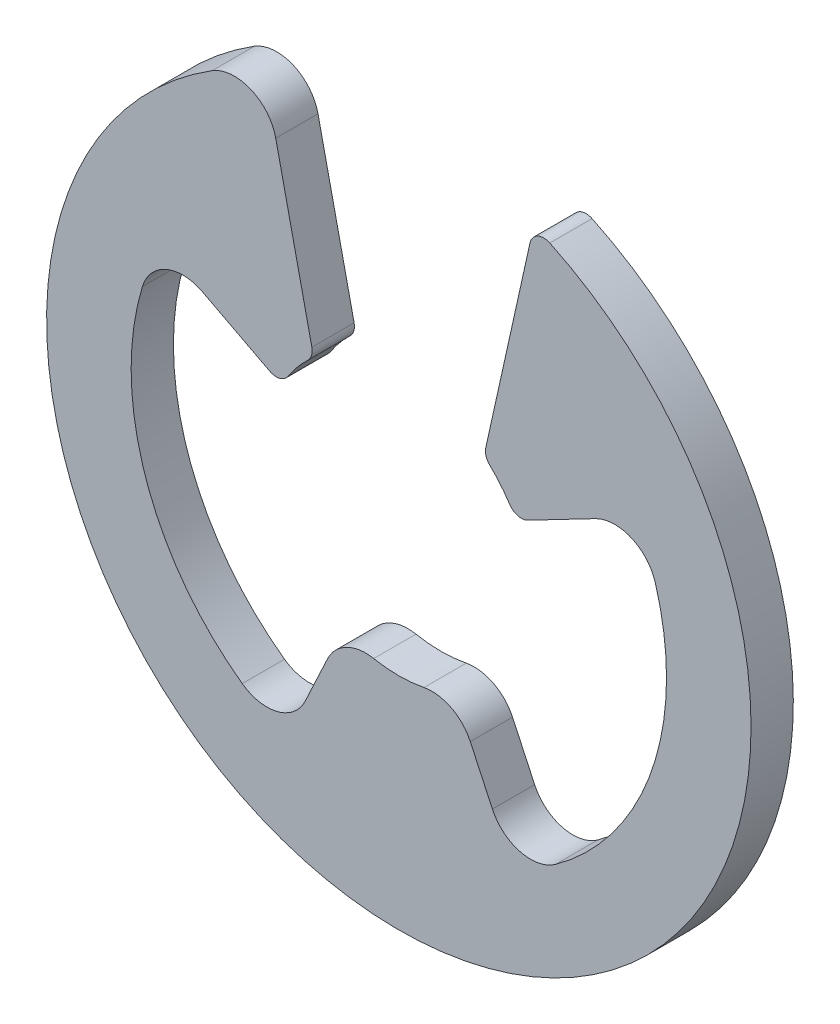
ISO-10303-21;
HEADER;
FILE_DESCRIPTION(('STEP AP214'),'2;1');
FILE_NAME('part.step','',(''),(''),'','','');
FILE_SCHEMA(('AUTOMOTIVE_DESIGN { 1 0 10303 214 1 1 1 1 }'));
ENDSEC;
DATA;
#1=APPLICATION_CONTEXT('core data for automotive mechanical design processes');
#2=APPLICATION_PROTOCOL_DEFINITION('international standard','automotive_design',2000,#1);
#3=PRODUCT_CONTEXT('',#1,'mechanical');
#4=PRODUCT('Part','Part','',(#3));
#5=PRODUCT_RELATED_PRODUCT_CATEGORY('part','',(#4));
#6=PRODUCT_DEFINITION_FORMATION('','',#4);
#7=PRODUCT_DEFINITION_CONTEXT('part definition',#1,'design');
#8=PRODUCT_DEFINITION('design','',#6,#7);
#9=PRODUCT_DEFINITION_SHAPE('','',#8);
#10=(LENGTH_UNIT() NAMED_UNIT(*) SI_UNIT(.MILLI.,.METRE.));
#11=(NAMED_UNIT(*) PLANE_ANGLE_UNIT() SI_UNIT($,.RADIAN.));
#12=(NAMED_UNIT(*) SI_UNIT($,.STERADIAN.) SOLID_ANGLE_UNIT());
#13=UNCERTAINTY_MEASURE_WITH_UNIT(LENGTH_MEASURE(1.E-05),#10,'distance_accuracy_value','');
#14=(GEOMETRIC_REPRESENTATION_CONTEXT(3) GLOBAL_UNCERTAINTY_ASSIGNED_CONTEXT((#13)) GLOBAL_UNIT_ASSIGNED_CONTEXT((#10,
#11,#12)) REPRESENTATION_CONTEXT('',''));
#15=CARTESIAN_POINT('',(0.,0.,0.));
#16=DIRECTION('',(0.,0.,1.));
#17=DIRECTION('',(1.,0.,0.));
#18=AXIS2_PLACEMENT_3D('',#15,#16,#17);
#19=CARTESIAN_POINT('',(0.,0.,0.1905));
#20=DIRECTION('',(0.,0.,1.));
#21=DIRECTION('',(1.,0.,0.));
#22=AXIS2_PLACEMENT_3D('',#19,#20,#21);
#23=PLANE('',#22);
#24=DIRECTION('',(0.216439613938083,0.976296007119938,0.));
#25=VECTOR('',#24,1.);
#26=CARTESIAN_POINT('',(0.539598954254984,-0.11962620812603,0.1905));
#27=LINE('',#26,#25);
#28=CARTESIAN_POINT('',(0.783911570769453,0.982396788737823,0.1905));
#29=VERTEX_POINT('',#28);
#30=CARTESIAN_POINT('',(1.18269461582631,2.78119086119221,0.1905));
#31=VERTEX_POINT('',#30);
#32=EDGE_CURVE('E213',#29,#31,#27,.T.);
#33=ORIENTED_EDGE('',*,*,#32,.F.);
#34=CARTESIAN_POINT('',(0.907901163673686,0.954908957767687,0.1905));
#35=DIRECTION('',(0.,0.,1.));
#36=DIRECTION('',(1.,0.,0.));
#37=AXIS2_PLACEMENT_3D('',#34,#35,#36);
#38=CIRCLE('',#37,0.127);
#39=CARTESIAN_POINT('',(0.820392617777427,0.862869540151524,0.1905));
#40=VERTEX_POINT('',#39);
#41=EDGE_CURVE('E196',#29,#40,#38,.T.);
#42=ORIENTED_EDGE('',*,*,#41,.T.);
#43=CARTESIAN_POINT('',(0.,0.,0.1905));
#44=DIRECTION('',(0.,0.,1.));
#45=DIRECTION('',(1.,0.,0.));
#46=AXIS2_PLACEMENT_3D('',#43,#44,#45);
#47=CIRCLE('',#46,1.190625);
#48=CARTESIAN_POINT('',(0.998190337560011,0.649002265502081,0.1905));
#49=VERTEX_POINT('',#48);
#50=EDGE_CURVE('E232',#49,#40,#47,.T.);
#51=ORIENTED_EDGE('',*,*,#50,.F.);
#52=CARTESIAN_POINT('',(1.10466397356641,0.718229173822303,0.1905));
#53=DIRECTION('',(0.,0.,1.));
#54=DIRECTION('',(1.,0.,0.));
#55=AXIS2_PLACEMENT_3D('',#52,#53,#54);
#56=CIRCLE('',#55,0.127);
#57=CARTESIAN_POINT('',(1.16330604744726,0.605578798008671,0.1905));
#58=VERTEX_POINT('',#57);
#59=EDGE_CURVE('E207',#49,#58,#56,.T.);
#60=ORIENTED_EDGE('',*,*,#59,.T.);
#61=DIRECTION('',(-0.88701083317821,-0.461748613235057,0.));
#62=VECTOR('',#61,1.);
#63=CARTESIAN_POINT('',(0.,0.,0.1905));
#64=LINE('',#63,#62);
#65=CARTESIAN_POINT('',(1.77043962654063,0.921632534568249,0.1905));
#66=VERTEX_POINT('',#65);
#67=EDGE_CURVE('E397',#66,#58,#64,.T.);
#68=ORIENTED_EDGE('',*,*,#67,.F.);
#69=CARTESIAN_POINT('',(1.94636584818318,0.583681407127351,0.1905));
#70=DIRECTION('',(0.,0.,1.));
#71=DIRECTION('',(1.,0.,0.));
#72=AXIS2_PLACEMENT_3D('',#69,#70,#71);
#73=CIRCLE('',#72,0.381);
#74=CARTESIAN_POINT('',(2.31130944471753,0.693121670963728,0.1905));
#75=VERTEX_POINT('',#74);
#76=EDGE_CURVE('E326',#66,#75,#73,.F.);
#77=ORIENTED_EDGE('',*,*,#76,.T.);
#78=CARTESIAN_POINT('',(0.,0.,0.1905));
#79=DIRECTION('',(0.,0.,1.));
#80=DIRECTION('',(1.,0.,0.));
#81=AXIS2_PLACEMENT_3D('',#78,#79,#80);
#82=CIRCLE('',#81,2.413);
#83=CARTESIAN_POINT('',(1.4114582097649,-1.95712920423953,0.1905));
#84=VERTEX_POINT('',#83);
#85=EDGE_CURVE('E394',#84,#75,#82,.T.);
#86=ORIENTED_EDGE('',*,*,#85,.F.);
#87=CARTESIAN_POINT('',(1.18859638717044,-1.64810880357013,0.1905));
#88=DIRECTION('',(0.,0.,1.));
#89=DIRECTION('',(1.,0.,0.));
#90=AXIS2_PLACEMENT_3D('',#87,#88,#89);
#91=CIRCLE('',#90,0.381);
#92=CARTESIAN_POINT('',(0.843293120309479,-1.80912636129334,0.1905));
#93=VERTEX_POINT('',#92);
#94=EDGE_CURVE('E330',#84,#93,#91,.F.);
#95=ORIENTED_EDGE('',*,*,#94,.T.);
#96=DIRECTION('',(0.4226182617407,-0.90630778703665,0.));
#97=VECTOR('',#96,1.);
#98=CARTESIAN_POINT('',(-0.000259853295256014,-0.000121171581574692,0.1905));
#99=LINE('',#98,#97);
#100=CARTESIAN_POINT('',(0.644094498053936,-1.38194353731036,0.1905));
#101=VERTEX_POINT('',#100);
#102=EDGE_CURVE('E363',#101,#93,#99,.T.);
#103=ORIENTED_EDGE('',*,*,#102,.F.);
#104=CARTESIAN_POINT('',(0.298791231192973,-1.54296109503357,0.1905));
#105=DIRECTION('',(0.,0.,1.));
#106=DIRECTION('',(1.,0.,0.));
#107=AXIS2_PLACEMENT_3D('',#104,#105,#106);
#108=CIRCLE('',#107,0.381);
#109=CARTESIAN_POINT('',(0.22635699332801,-1.16890992047998,0.1905));
#110=VERTEX_POINT('',#109);
#111=EDGE_CURVE('E250',#101,#110,#108,.T.);
#112=ORIENTED_EDGE('',*,*,#111,.T.);
#113=CARTESIAN_POINT('',(-0.22635699332801,-1.16890992047998,0.1905));
#114=VERTEX_POINT('',#113);
#115=EDGE_CURVE('E234',#114,#110,#47,.T.);
#116=ORIENTED_EDGE('',*,*,#115,.F.);
#117=CARTESIAN_POINT('',(-0.298791231192973,-1.54296109503357,0.1905));
#118=DIRECTION('',(0.,0.,1.));
#119=DIRECTION('',(1.,0.,0.));
#120=AXIS2_PLACEMENT_3D('',#117,#118,#119);
#121=CIRCLE('',#120,0.381);
#122=CARTESIAN_POINT('',(-0.644094498053936,-1.38194353731036,0.1905));
#123=VERTEX_POINT('',#122);
#124=EDGE_CURVE('E248',#114,#123,#121,.T.);
#125=ORIENTED_EDGE('',*,*,#124,.T.);
#126=DIRECTION('',(-0.4226182617407,-0.90630778703665,0.));
#127=VECTOR('',#126,1.);
#128=CARTESIAN_POINT('',(0.000259853295256014,-0.000121171581574692,0.1905));
#129=LINE('',#128,#127);
#130=CARTESIAN_POINT('',(-0.843293120309479,-1.80912636129334,0.1905));
#131=VERTEX_POINT('',#130);
#132=EDGE_CURVE('E365',#123,#131,#129,.T.);
#133=ORIENTED_EDGE('',*,*,#132,.T.);
#134=CARTESIAN_POINT('',(-1.18859638717044,-1.64810880357013,0.1905));
#135=DIRECTION('',(0.,0.,1.));
#136=DIRECTION('',(1.,0.,0.));
#137=AXIS2_PLACEMENT_3D('',#134,#135,#136);
#138=CIRCLE('',#137,0.381);
#139=CARTESIAN_POINT('',(-1.4114582097649,-1.95712920423953,0.1905));
#140=VERTEX_POINT('',#139);
#141=EDGE_CURVE('E334',#131,#140,#138,.F.);
#142=ORIENTED_EDGE('',*,*,#141,.T.);
#143=CARTESIAN_POINT('',(0.,0.,0.1905));
#144=DIRECTION('',(0.,0.,1.));
#145=DIRECTION('',(1.,0.,0.));
#146=AXIS2_PLACEMENT_3D('',#143,#144,#145);
#147=CIRCLE('',#146,2.413);
#148=CARTESIAN_POINT('',(-2.31130944471753,0.693121670963728,0.1905));
#149=VERTEX_POINT('',#148);
#150=EDGE_CURVE('E341',#149,#140,#147,.T.);
#151=ORIENTED_EDGE('',*,*,#150,.F.);
#152=CARTESIAN_POINT('',(-1.94636584818318,0.583681407127351,0.1905));
#153=DIRECTION('',(0.,0.,1.));
#154=DIRECTION('',(1.,0.,0.));
#155=AXIS2_PLACEMENT_3D('',#152,#153,#154);
#156=CIRCLE('',#155,0.381);
#157=CARTESIAN_POINT('',(-1.77043962654063,0.921632534568249,0.1905));
#158=VERTEX_POINT('',#157);
#159=EDGE_CURVE('E42',#149,#158,#156,.F.);
#160=ORIENTED_EDGE('',*,*,#159,.T.);
#161=DIRECTION('',(0.88701083317821,-0.461748613235057,0.));
#162=VECTOR('',#161,1.);
#163=CARTESIAN_POINT('',(0.,0.,0.1905));
#164=LINE('',#163,#162);
#165=CARTESIAN_POINT('',(-1.16330604744726,0.605578798008671,0.1905));
#166=VERTEX_POINT('',#165);
#167=EDGE_CURVE('E339',#158,#166,#164,.T.);
#168=ORIENTED_EDGE('',*,*,#167,.T.);
#169=CARTESIAN_POINT('',(-1.10466397356641,0.718229173822303,0.1905));
#170=DIRECTION('',(0.,0.,1.));
#171=DIRECTION('',(1.,0.,0.));
#172=AXIS2_PLACEMENT_3D('',#169,#170,#171);
#173=CIRCLE('',#172,0.127);
#174=CARTESIAN_POINT('',(-0.998190337560011,0.649002265502081,0.1905));
#175=VERTEX_POINT('',#174);
#176=EDGE_CURVE('E255',#166,#175,#173,.T.);
#177=ORIENTED_EDGE('',*,*,#176,.T.);
#178=CARTESIAN_POINT('',(-0.820392617777427,0.862869540151524,0.1905));
#179=VERTEX_POINT('',#178);
#180=EDGE_CURVE('E236',#179,#175,#47,.T.);
#181=ORIENTED_EDGE('',*,*,#180,.F.);
#182=CARTESIAN_POINT('',(-0.907901163673685,0.954908957767687,0.1905));
#183=DIRECTION('',(0.,0.,1.));
#184=DIRECTION('',(1.,0.,0.));
#185=AXIS2_PLACEMENT_3D('',#182,#183,#184);
#186=CIRCLE('',#185,0.127);
#187=CARTESIAN_POINT('',(-0.783911570769453,0.982396788737824,0.1905));
#188=VERTEX_POINT('',#187);
#189=EDGE_CURVE('E253',#179,#188,#186,.T.);
#190=ORIENTED_EDGE('',*,*,#189,.T.);
#191=DIRECTION('',(0.216439613938083,-0.976296007119938,0.));
#192=VECTOR('',#191,1.);
#193=CARTESIAN_POINT('',(-0.539598954254984,-0.11962620812603,0.1905));
#194=LINE('',#193,#192);
#195=CARTESIAN_POINT('',(-1.10956464167249,2.45132286490398,0.1905));
#196=VERTEX_POINT('',#195);
#197=EDGE_CURVE('E223',#196,#188,#194,.T.);
#198=ORIENTED_EDGE('',*,*,#197,.F.);
#199=CARTESIAN_POINT('',(-1.48153342038519,2.36885937199357,0.1905));
#200=DIRECTION('',(0.,0.,1.));
#201=DIRECTION('',(1.,0.,0.));
#202=AXIS2_PLACEMENT_3D('',#199,#200,#201);
#203=CIRCLE('',#202,0.381);
#204=CARTESIAN_POINT('',(-1.68356070498317,2.69188564999269,0.1905));
#205=VERTEX_POINT('',#204);
#206=EDGE_CURVE('E217',#196,#205,#203,.T.);
#207=ORIENTED_EDGE('',*,*,#206,.T.);
#208=CARTESIAN_POINT('',(0.,0.,0.1905));
#209=DIRECTION('',(0.,0.,1.));
#210=DIRECTION('',(1.,0.,0.));
#211=AXIS2_PLACEMENT_3D('',#208,#209,#210);
#212=CIRCLE('',#211,3.175);
#213=CARTESIAN_POINT('',(1.36112938409431,2.86844065648133,0.1905));
#214=VERTEX_POINT('',#213);
#215=EDGE_CURVE('E241',#205,#214,#212,.T.);
#216=ORIENTED_EDGE('',*,*,#215,.T.);
#217=CARTESIAN_POINT('',(1.30668420873054,2.75370303022208,0.1905));
#218=DIRECTION('',(0.,0.,1.));
#219=DIRECTION('',(1.,0.,0.));
#220=AXIS2_PLACEMENT_3D('',#217,#218,#219);
#221=CIRCLE('',#220,0.127);
#222=EDGE_CURVE('E221',#214,#31,#221,.T.);
#223=ORIENTED_EDGE('',*,*,#222,.T.);
#224=EDGE_LOOP('',(#33,#42,#51,#60,#68,#77,#86,#95,#103,#112,#116,#125,#133,#142,#151,#160,#168,
#177,#181,#190,#198,#207,#216,#223));
#225=FACE_BOUND('',#224,.T.);
#226=ADVANCED_FACE('F34',(#225),#23,.T.);
#227=CARTESIAN_POINT('',(0.,0.,-0.1905));
#228=DIRECTION('',(0.,0.,1.));
#229=DIRECTION('',(1.,0.,0.));
#230=AXIS2_PLACEMENT_3D('',#227,#228,#229);
#231=PLANE('',#230);
#232=CARTESIAN_POINT('',(0.,0.,-0.1905));
#233=DIRECTION('',(0.,0.,1.));
#234=DIRECTION('',(1.,0.,0.));
#235=AXIS2_PLACEMENT_3D('',#232,#233,#234);
#236=CIRCLE('',#235,1.190625);
#237=CARTESIAN_POINT('',(0.998190337560011,0.649002265502081,-0.1905));
#238=VERTEX_POINT('',#237);
#239=CARTESIAN_POINT('',(0.820392617777427,0.862869540151524,-0.1905));
#240=VERTEX_POINT('',#239);
#241=EDGE_CURVE('E240',#238,#240,#236,.T.);
#242=ORIENTED_EDGE('',*,*,#241,.T.);
#243=CARTESIAN_POINT('',(0.907901163673686,0.954908957767687,-0.1905));
#244=DIRECTION('',(0.,0.,1.));
#245=DIRECTION('',(1.,0.,0.));
#246=AXIS2_PLACEMENT_3D('',#243,#244,#245);
#247=CIRCLE('',#246,0.127);
#248=CARTESIAN_POINT('',(0.783911570769453,0.982396788737823,-0.1905));
#249=VERTEX_POINT('',#248);
#250=EDGE_CURVE('E275',#240,#249,#247,.F.);
#251=ORIENTED_EDGE('',*,*,#250,.T.);
#252=DIRECTION('',(0.216439613938083,0.976296007119938,0.));
#253=VECTOR('',#252,1.);
#254=CARTESIAN_POINT('',(0.539598954254984,-0.11962620812603,-0.1905));
#255=LINE('',#254,#253);
#256=CARTESIAN_POINT('',(1.18269461582631,2.78119086119221,-0.1905));
#257=VERTEX_POINT('',#256);
#258=EDGE_CURVE('E216',#249,#257,#255,.T.);
#259=ORIENTED_EDGE('',*,*,#258,.T.);
#260=CARTESIAN_POINT('',(1.30668420873054,2.75370303022208,-0.1905));
#261=DIRECTION('',(0.,0.,1.));
#262=DIRECTION('',(1.,0.,0.));
#263=AXIS2_PLACEMENT_3D('',#260,#261,#262);
#264=CIRCLE('',#263,0.127);
#265=CARTESIAN_POINT('',(1.36112938409431,2.86844065648133,-0.1905));
#266=VERTEX_POINT('',#265);
#267=EDGE_CURVE('E267',#257,#266,#264,.F.);
#268=ORIENTED_EDGE('',*,*,#267,.T.);
#269=CARTESIAN_POINT('',(0.,0.,-0.1905));
#270=DIRECTION('',(0.,0.,1.));
#271=DIRECTION('',(1.,0.,0.));
#272=AXIS2_PLACEMENT_3D('',#269,#270,#271);
#273=CIRCLE('',#272,3.175);
#274=CARTESIAN_POINT('',(-1.68356070498317,2.69188564999269,-0.1905));
#275=VERTEX_POINT('',#274);
#276=EDGE_CURVE('E243',#275,#266,#273,.T.);
#277=ORIENTED_EDGE('',*,*,#276,.F.);
#278=CARTESIAN_POINT('',(-1.48153342038519,2.36885937199357,-0.1905));
#279=DIRECTION('',(0.,0.,1.));
#280=DIRECTION('',(1.,0.,0.));
#281=AXIS2_PLACEMENT_3D('',#278,#279,#280);
#282=CIRCLE('',#281,0.381);
#283=CARTESIAN_POINT('',(-1.10956464167249,2.45132286490398,-0.1905));
#284=VERTEX_POINT('',#283);
#285=EDGE_CURVE('E261',#275,#284,#282,.F.);
#286=ORIENTED_EDGE('',*,*,#285,.T.);
#287=DIRECTION('',(0.216439613938083,-0.976296007119938,0.));
#288=VECTOR('',#287,1.);
#289=CARTESIAN_POINT('',(-0.539598954254984,-0.11962620812603,-0.1905));
#290=LINE('',#289,#288);
#291=CARTESIAN_POINT('',(-0.783911570769453,0.982396788737824,-0.1905));
#292=VERTEX_POINT('',#291);
#293=EDGE_CURVE('E222',#284,#292,#290,.T.);
#294=ORIENTED_EDGE('',*,*,#293,.T.);
#295=CARTESIAN_POINT('',(-0.907901163673685,0.954908957767687,-0.1905));
#296=DIRECTION('',(0.,0.,1.));
#297=DIRECTION('',(1.,0.,0.));
#298=AXIS2_PLACEMENT_3D('',#295,#296,#297);
#299=CIRCLE('',#298,0.127);
#300=CARTESIAN_POINT('',(-0.820392617777427,0.862869540151524,-0.1905));
#301=VERTEX_POINT('',#300);
#302=EDGE_CURVE('E269',#292,#301,#299,.F.);
#303=ORIENTED_EDGE('',*,*,#302,.T.);
#304=CARTESIAN_POINT('',(-0.998190337560011,0.649002265502081,-0.1905));
#305=VERTEX_POINT('',#304);
#306=EDGE_CURVE('E235',#301,#305,#236,.T.);
#307=ORIENTED_EDGE('',*,*,#306,.T.);
#308=CARTESIAN_POINT('',(-1.10466397356641,0.718229173822303,-0.1905));
#309=DIRECTION('',(0.,0.,1.));
#310=DIRECTION('',(1.,0.,0.));
#311=AXIS2_PLACEMENT_3D('',#308,#309,#310);
#312=CIRCLE('',#311,0.127);
#313=CARTESIAN_POINT('',(-1.16330604744726,0.605578798008671,-0.1905));
#314=VERTEX_POINT('',#313);
#315=EDGE_CURVE('E271',#305,#314,#312,.F.);
#316=ORIENTED_EDGE('',*,*,#315,.T.);
#317=DIRECTION('',(0.88701083317821,-0.461748613235057,0.));
#318=VECTOR('',#317,1.);
#319=CARTESIAN_POINT('',(0.,0.,-0.1905));
#320=LINE('',#319,#318);
#321=CARTESIAN_POINT('',(-1.77043962654063,0.921632534568249,-0.1905));
#322=VERTEX_POINT('',#321);
#323=EDGE_CURVE('E357',#322,#314,#320,.T.);
#324=ORIENTED_EDGE('',*,*,#323,.F.);
#325=CARTESIAN_POINT('',(-1.94636584818318,0.583681407127351,-0.1905));
#326=DIRECTION('',(0.,0.,1.));
#327=DIRECTION('',(1.,0.,0.));
#328=AXIS2_PLACEMENT_3D('',#325,#326,#327);
#329=CIRCLE('',#328,0.381);
#330=CARTESIAN_POINT('',(-2.31130944471753,0.693121670963728,-0.1905));
#331=VERTEX_POINT('',#330);
#332=EDGE_CURVE('E12',#322,#331,#329,.T.);
#333=ORIENTED_EDGE('',*,*,#332,.T.);
#334=CARTESIAN_POINT('',(0.,0.,-0.1905));
#335=DIRECTION('',(0.,0.,1.));
#336=DIRECTION('',(1.,0.,0.));
#337=AXIS2_PLACEMENT_3D('',#334,#335,#336);
#338=CIRCLE('',#337,2.413);
#339=CARTESIAN_POINT('',(-1.4114582097649,-1.95712920423953,-0.1905));
#340=VERTEX_POINT('',#339);
#341=EDGE_CURVE('E356',#331,#340,#338,.T.);
#342=ORIENTED_EDGE('',*,*,#341,.T.);
#343=CARTESIAN_POINT('',(-1.18859638717044,-1.64810880357013,-0.1905));
#344=DIRECTION('',(0.,0.,1.));
#345=DIRECTION('',(1.,0.,0.));
#346=AXIS2_PLACEMENT_3D('',#343,#344,#345);
#347=CIRCLE('',#346,0.381);
#348=CARTESIAN_POINT('',(-0.843293120309479,-1.80912636129334,-0.1905));
#349=VERTEX_POINT('',#348);
#350=EDGE_CURVE('E49',#340,#349,#347,.T.);
#351=ORIENTED_EDGE('',*,*,#350,.T.);
#352=DIRECTION('',(-0.4226182617407,-0.90630778703665,0.));
#353=VECTOR('',#352,1.);
#354=CARTESIAN_POINT('',(0.000259853295256014,-0.000121171581574692,-0.1905));
#355=LINE('',#354,#353);
#356=CARTESIAN_POINT('',(-0.644094498053936,-1.38194353731036,-0.1905));
#357=VERTEX_POINT('',#356);
#358=EDGE_CURVE('E361',#357,#349,#355,.T.);
#359=ORIENTED_EDGE('',*,*,#358,.F.);
#360=CARTESIAN_POINT('',(-0.298791231192973,-1.54296109503357,-0.1905));
#361=DIRECTION('',(0.,0.,1.));
#362=DIRECTION('',(1.,0.,0.));
#363=AXIS2_PLACEMENT_3D('',#360,#361,#362);
#364=CIRCLE('',#363,0.381);
#365=CARTESIAN_POINT('',(-0.22635699332801,-1.16890992047998,-0.1905));
#366=VERTEX_POINT('',#365);
#367=EDGE_CURVE('E263',#357,#366,#364,.F.);
#368=ORIENTED_EDGE('',*,*,#367,.T.);
#369=CARTESIAN_POINT('',(0.22635699332801,-1.16890992047998,-0.1905));
#370=VERTEX_POINT('',#369);
#371=EDGE_CURVE('E239',#366,#370,#236,.T.);
#372=ORIENTED_EDGE('',*,*,#371,.T.);
#373=CARTESIAN_POINT('',(0.298791231192973,-1.54296109503357,-0.1905));
#374=DIRECTION('',(0.,0.,1.));
#375=DIRECTION('',(1.,0.,0.));
#376=AXIS2_PLACEMENT_3D('',#373,#374,#375);
#377=CIRCLE('',#376,0.381);
#378=CARTESIAN_POINT('',(0.644094498053936,-1.38194353731036,-0.1905));
#379=VERTEX_POINT('',#378);
#380=EDGE_CURVE('E265',#370,#379,#377,.F.);
#381=ORIENTED_EDGE('',*,*,#380,.T.);
#382=DIRECTION('',(0.4226182617407,-0.90630778703665,0.));
#383=VECTOR('',#382,1.);
#384=CARTESIAN_POINT('',(-0.000259853295256014,-0.000121171581574692,-0.1905));
#385=LINE('',#384,#383);
#386=CARTESIAN_POINT('',(0.843293120309479,-1.80912636129334,-0.1905));
#387=VERTEX_POINT('',#386);
#388=EDGE_CURVE('E390',#379,#387,#385,.T.);
#389=ORIENTED_EDGE('',*,*,#388,.T.);
#390=CARTESIAN_POINT('',(1.18859638717044,-1.64810880357013,-0.1905));
#391=DIRECTION('',(0.,0.,1.));
#392=DIRECTION('',(1.,0.,0.));
#393=AXIS2_PLACEMENT_3D('',#390,#391,#392);
#394=CIRCLE('',#393,0.381);
#395=CARTESIAN_POINT('',(1.4114582097649,-1.95712920423953,-0.1905));
#396=VERTEX_POINT('',#395);
#397=EDGE_CURVE('E332',#387,#396,#394,.T.);
#398=ORIENTED_EDGE('',*,*,#397,.T.);
#399=CARTESIAN_POINT('',(0.,0.,-0.1905));
#400=DIRECTION('',(0.,0.,1.));
#401=DIRECTION('',(1.,0.,0.));
#402=AXIS2_PLACEMENT_3D('',#399,#400,#401);
#403=CIRCLE('',#402,2.413);
#404=CARTESIAN_POINT('',(2.31130944471753,0.693121670963728,-0.1905));
#405=VERTEX_POINT('',#404);
#406=EDGE_CURVE('E405',#396,#405,#403,.T.);
#407=ORIENTED_EDGE('',*,*,#406,.T.);
#408=CARTESIAN_POINT('',(1.94636584818318,0.583681407127351,-0.1905));
#409=DIRECTION('',(0.,0.,1.));
#410=DIRECTION('',(1.,0.,0.));
#411=AXIS2_PLACEMENT_3D('',#408,#409,#410);
#412=CIRCLE('',#411,0.381);
#413=CARTESIAN_POINT('',(1.77043962654063,0.921632534568249,-0.1905));
#414=VERTEX_POINT('',#413);
#415=EDGE_CURVE('E328',#405,#414,#412,.T.);
#416=ORIENTED_EDGE('',*,*,#415,.T.);
#417=DIRECTION('',(-0.88701083317821,-0.461748613235057,0.));
#418=VECTOR('',#417,1.);
#419=CARTESIAN_POINT('',(0.,0.,-0.1905));
#420=LINE('',#419,#418);
#421=CARTESIAN_POINT('',(1.16330604744726,0.605578798008671,-0.1905));
#422=VERTEX_POINT('',#421);
#423=EDGE_CURVE('E228',#414,#422,#420,.T.);
#424=ORIENTED_EDGE('',*,*,#423,.T.);
#425=CARTESIAN_POINT('',(1.10466397356641,0.718229173822303,-0.1905));
#426=DIRECTION('',(0.,0.,1.));
#427=DIRECTION('',(1.,0.,0.));
#428=AXIS2_PLACEMENT_3D('',#425,#426,#427);
#429=CIRCLE('',#428,0.127);
#430=EDGE_CURVE('E273',#422,#238,#429,.F.);
#431=ORIENTED_EDGE('',*,*,#430,.T.);
#432=EDGE_LOOP('',(#242,#251,#259,#268,#277,#286,#294,#303,#307,#316,#324,#333,#342,#351,#359,
#368,#372,#381,#389,#398,#407,#416,#424,#431));
#433=FACE_BOUND('',#432,.T.);
#434=ADVANCED_FACE('F355',(#433),#231,.F.);
#435=CARTESIAN_POINT('',(0.,0.,0.1905));
#436=DIRECTION('',(0.,0.,-1.));
#437=DIRECTION('',(-1.,0.,0.));
#438=AXIS2_PLACEMENT_3D('',#435,#436,#437);
#439=CYLINDRICAL_SURFACE('',#438,1.190625);
#440=ORIENTED_EDGE('',*,*,#115,.T.);
#441=DIRECTION('',(0.,0.,-1.));
#442=VECTOR('',#441,1.);
#443=CARTESIAN_POINT('',(0.22635699332801,-1.16890992047998,0.1905));
#444=LINE('',#443,#442);
#445=EDGE_CURVE('E315',#110,#370,#444,.T.);
#446=ORIENTED_EDGE('',*,*,#445,.T.);
#447=ORIENTED_EDGE('',*,*,#371,.F.);
#448=DIRECTION('',(0.,0.,-1.));
#449=VECTOR('',#448,1.);
#450=CARTESIAN_POINT('',(-0.22635699332801,-1.16890992047998,0.1905));
#451=LINE('',#450,#449);
#452=EDGE_CURVE('E312',#366,#114,#451,.F.);
#453=ORIENTED_EDGE('',*,*,#452,.T.);
#454=EDGE_LOOP('',(#440,#446,#447,#453));
#455=FACE_BOUND('',#454,.T.);
#456=ADVANCED_FACE('F440',(#455),#439,.F.);
#457=ORIENTED_EDGE('',*,*,#180,.T.);
#458=DIRECTION('',(0.,0.,-1.));
#459=VECTOR('',#458,1.);
#460=CARTESIAN_POINT('',(-0.99819033756001,0.649002265502081,0.1905));
#461=LINE('',#460,#459);
#462=EDGE_CURVE('E290',#175,#305,#461,.T.);
#463=ORIENTED_EDGE('',*,*,#462,.T.);
#464=ORIENTED_EDGE('',*,*,#306,.F.);
#465=DIRECTION('',(0.,0.,-1.));
#466=VECTOR('',#465,1.);
#467=CARTESIAN_POINT('',(-0.820392617777427,0.862869540151524,0.1905));
#468=LINE('',#467,#466);
#469=EDGE_CURVE('E287',#301,#179,#468,.F.);
#470=ORIENTED_EDGE('',*,*,#469,.T.);
#471=EDGE_LOOP('',(#457,#463,#464,#470));
#472=FACE_BOUND('',#471,.T.);
#473=ADVANCED_FACE('F502',(#472),#439,.F.);
#474=ORIENTED_EDGE('',*,*,#50,.T.);
#475=DIRECTION('',(0.,0.,-1.));
#476=VECTOR('',#475,1.);
#477=CARTESIAN_POINT('',(0.820392617777427,0.862869540151524,0.1905));
#478=LINE('',#477,#476);
#479=EDGE_CURVE('E201',#40,#240,#478,.T.);
#480=ORIENTED_EDGE('',*,*,#479,.T.);
#481=ORIENTED_EDGE('',*,*,#241,.F.);
#482=DIRECTION('',(0.,0.,-1.));
#483=VECTOR('',#482,1.);
#484=CARTESIAN_POINT('',(0.99819033756001,0.649002265502081,0.1905));
#485=LINE('',#484,#483);
#486=EDGE_CURVE('E206',#238,#49,#485,.F.);
#487=ORIENTED_EDGE('',*,*,#486,.T.);
#488=EDGE_LOOP('',(#474,#480,#481,#487));
#489=FACE_BOUND('',#488,.T.);
#490=ADVANCED_FACE('F419',(#489),#439,.F.);
#491=CARTESIAN_POINT('',(0.,0.,0.1905));
#492=DIRECTION('',(0.,0.,-1.));
#493=DIRECTION('',(-1.,0.,0.));
#494=AXIS2_PLACEMENT_3D('',#491,#492,#493);
#495=CYLINDRICAL_SURFACE('',#494,3.175);
#496=ORIENTED_EDGE('',*,*,#276,.T.);
#497=DIRECTION('',(0.,0.,-1.));
#498=VECTOR('',#497,1.);
#499=CARTESIAN_POINT('',(1.36112938409431,2.86844065648133,0.1905));
#500=LINE('',#499,#498);
#501=EDGE_CURVE('E299',#266,#214,#500,.F.);
#502=ORIENTED_EDGE('',*,*,#501,.T.);
#503=ORIENTED_EDGE('',*,*,#215,.F.);
#504=DIRECTION('',(0.,0.,-1.));
#505=VECTOR('',#504,1.);
#506=CARTESIAN_POINT('',(-1.68356070498317,2.69188564999269,0.1905));
#507=LINE('',#506,#505);
#508=EDGE_CURVE('E297',#205,#275,#507,.T.);
#509=ORIENTED_EDGE('',*,*,#508,.T.);
#510=EDGE_LOOP('',(#496,#502,#503,#509));
#511=FACE_BOUND('',#510,.T.);
#512=ADVANCED_FACE('F445',(#511),#495,.T.);
#513=CARTESIAN_POINT('',(-0.539598954254984,-0.11962620812603,-0.1905));
#514=DIRECTION('',(-0.976296007119938,-0.216439613938082,0.));
#515=DIRECTION('',(0.216439613938082,-0.976296007119938,0.));
#516=AXIS2_PLACEMENT_3D('',#513,#514,#515);
#517=PLANE('',#516);
#518=ORIENTED_EDGE('',*,*,#197,.T.);
#519=DIRECTION('',(0.,0.,1.));
#520=VECTOR('',#519,1.);
#521=CARTESIAN_POINT('',(-0.783911570769453,0.982396788737823,-0.1905));
#522=LINE('',#521,#520);
#523=EDGE_CURVE('E295',#188,#292,#522,.F.);
#524=ORIENTED_EDGE('',*,*,#523,.T.);
#525=ORIENTED_EDGE('',*,*,#293,.F.);
#526=DIRECTION('',(0.,0.,-1.));
#527=VECTOR('',#526,1.);
#528=CARTESIAN_POINT('',(-1.10956464167249,2.45132286490398,-0.1905));
#529=LINE('',#528,#527);
#530=EDGE_CURVE('E292',#284,#196,#529,.F.);
#531=ORIENTED_EDGE('',*,*,#530,.T.);
#532=EDGE_LOOP('',(#518,#524,#525,#531));
#533=FACE_BOUND('',#532,.T.);
#534=ADVANCED_FACE('F448',(#533),#517,.F.);
#535=CARTESIAN_POINT('',(0.539598954254984,-0.11962620812603,-0.1905));
#536=DIRECTION('',(0.976296007119938,-0.216439613938082,0.));
#537=DIRECTION('',(0.216439613938082,0.976296007119938,0.));
#538=AXIS2_PLACEMENT_3D('',#535,#536,#537);
#539=PLANE('',#538);
#540=ORIENTED_EDGE('',*,*,#258,.F.);
#541=DIRECTION('',(0.,0.,1.));
#542=VECTOR('',#541,1.);
#543=CARTESIAN_POINT('',(0.783911570769453,0.982396788737823,0.1905));
#544=LINE('',#543,#542);
#545=EDGE_CURVE('E200',#249,#29,#544,.T.);
#546=ORIENTED_EDGE('',*,*,#545,.T.);
#547=ORIENTED_EDGE('',*,*,#32,.T.);
#548=DIRECTION('',(0.,0.,-1.));
#549=VECTOR('',#548,1.);
#550=CARTESIAN_POINT('',(1.18269461582631,2.78119086119221,-0.1905));
#551=LINE('',#550,#549);
#552=EDGE_CURVE('E218',#31,#257,#551,.T.);
#553=ORIENTED_EDGE('',*,*,#552,.T.);
#554=EDGE_LOOP('',(#540,#546,#547,#553));
#555=FACE_BOUND('',#554,.T.);
#556=ADVANCED_FACE('F212',(#555),#539,.F.);
#557=CARTESIAN_POINT('',(0.,0.,-0.1905));
#558=DIRECTION('',(-0.461748613235057,-0.88701083317821,0.));
#559=DIRECTION('',(0.88701083317821,-0.461748613235057,0.));
#560=AXIS2_PLACEMENT_3D('',#557,#558,#559);
#561=PLANE('',#560);
#562=ORIENTED_EDGE('',*,*,#323,.T.);
#563=DIRECTION('',(0.,0.,-1.));
#564=VECTOR('',#563,1.);
#565=CARTESIAN_POINT('',(-1.16330604744726,0.605578798008671,-0.1905));
#566=LINE('',#565,#564);
#567=EDGE_CURVE('E284',#314,#166,#566,.F.);
#568=ORIENTED_EDGE('',*,*,#567,.T.);
#569=ORIENTED_EDGE('',*,*,#167,.F.);
#570=DIRECTION('',(0.,0.,1.));
#571=VECTOR('',#570,1.);
#572=CARTESIAN_POINT('',(-1.77043962654063,0.921632534568249,-0.1905));
#573=LINE('',#572,#571);
#574=EDGE_CURVE('E282',#158,#322,#573,.F.);
#575=ORIENTED_EDGE('',*,*,#574,.T.);
#576=EDGE_LOOP('',(#562,#568,#569,#575));
#577=FACE_BOUND('',#576,.T.);
#578=ADVANCED_FACE('F347',(#577),#561,.T.);
#579=CARTESIAN_POINT('',(0.000259853295256014,-0.000121171581574692,-0.1905));
#580=DIRECTION('',(-0.90630778703665,0.4226182617407,0.));
#581=DIRECTION('',(-0.4226182617407,-0.90630778703665,0.));
#582=AXIS2_PLACEMENT_3D('',#579,#580,#581);
#583=PLANE('',#582);
#584=ORIENTED_EDGE('',*,*,#132,.F.);
#585=DIRECTION('',(0.,0.,-1.));
#586=VECTOR('',#585,1.);
#587=CARTESIAN_POINT('',(-0.644094498053936,-1.38194353731036,-0.1905));
#588=LINE('',#587,#586);
#589=EDGE_CURVE('E56',#123,#357,#588,.T.);
#590=ORIENTED_EDGE('',*,*,#589,.T.);
#591=ORIENTED_EDGE('',*,*,#358,.T.);
#592=DIRECTION('',(0.,0.,1.));
#593=VECTOR('',#592,1.);
#594=CARTESIAN_POINT('',(-0.843293120309478,-1.80912636129334,-0.1905));
#595=LINE('',#594,#593);
#596=EDGE_CURVE('E317',#349,#131,#595,.T.);
#597=ORIENTED_EDGE('',*,*,#596,.T.);
#598=EDGE_LOOP('',(#584,#590,#591,#597));
#599=FACE_BOUND('',#598,.T.);
#600=ADVANCED_FACE('F505',(#599),#583,.T.);
#601=CARTESIAN_POINT('',(0.,0.,-0.1905));
#602=DIRECTION('',(0.,0.,1.));
#603=DIRECTION('',(1.,0.,0.));
#604=AXIS2_PLACEMENT_3D('',#601,#602,#603);
#605=CYLINDRICAL_SURFACE('',#604,2.413);
#606=ORIENTED_EDGE('',*,*,#150,.T.);
#607=DIRECTION('',(0.,0.,1.));
#608=VECTOR('',#607,1.);
#609=CARTESIAN_POINT('',(-1.4114582097649,-1.95712920423953,-0.1905));
#610=LINE('',#609,#608);
#611=EDGE_CURVE('E324',#140,#340,#610,.F.);
#612=ORIENTED_EDGE('',*,*,#611,.T.);
#613=ORIENTED_EDGE('',*,*,#341,.F.);
#614=DIRECTION('',(0.,0.,1.));
#615=VECTOR('',#614,1.);
#616=CARTESIAN_POINT('',(-2.31130944471753,0.693121670963728,-0.1905));
#617=LINE('',#616,#615);
#618=EDGE_CURVE('E321',#331,#149,#617,.T.);
#619=ORIENTED_EDGE('',*,*,#618,.T.);
#620=EDGE_LOOP('',(#606,#612,#613,#619));
#621=FACE_BOUND('',#620,.T.);
#622=ADVANCED_FACE('F359',(#621),#605,.F.);
#623=CARTESIAN_POINT('',(-0.000259853295256014,-0.000121171581574692,-0.1905));
#624=DIRECTION('',(-0.90630778703665,-0.4226182617407,0.));
#625=DIRECTION('',(0.4226182617407,-0.90630778703665,0.));
#626=AXIS2_PLACEMENT_3D('',#623,#624,#625);
#627=PLANE('',#626);
#628=ORIENTED_EDGE('',*,*,#102,.T.);
#629=DIRECTION('',(0.,0.,-1.));
#630=VECTOR('',#629,1.);
#631=CARTESIAN_POINT('',(0.843293120309478,-1.80912636129334,-0.1905));
#632=LINE('',#631,#630);
#633=EDGE_CURVE('E310',#93,#387,#632,.T.);
#634=ORIENTED_EDGE('',*,*,#633,.T.);
#635=ORIENTED_EDGE('',*,*,#388,.F.);
#636=DIRECTION('',(0.,0.,1.));
#637=VECTOR('',#636,1.);
#638=CARTESIAN_POINT('',(0.644094498053936,-1.38194353731036,0.1905));
#639=LINE('',#638,#637);
#640=EDGE_CURVE('E307',#379,#101,#639,.T.);
#641=ORIENTED_EDGE('',*,*,#640,.T.);
#642=EDGE_LOOP('',(#628,#634,#635,#641));
#643=FACE_BOUND('',#642,.T.);
#644=ADVANCED_FACE('F388',(#643),#627,.F.);
#645=CARTESIAN_POINT('',(0.,0.,-0.1905));
#646=DIRECTION('',(-0.461748613235057,0.88701083317821,0.));
#647=DIRECTION('',(-0.88701083317821,-0.461748613235057,0.));
#648=AXIS2_PLACEMENT_3D('',#645,#646,#647);
#649=PLANE('',#648);
#650=ORIENTED_EDGE('',*,*,#67,.T.);
#651=DIRECTION('',(0.,0.,1.));
#652=VECTOR('',#651,1.);
#653=CARTESIAN_POINT('',(1.16330604744726,0.605578798008671,-0.1905));
#654=LINE('',#653,#652);
#655=EDGE_CURVE('E280',#58,#422,#654,.F.);
#656=ORIENTED_EDGE('',*,*,#655,.T.);
#657=ORIENTED_EDGE('',*,*,#423,.F.);
#658=DIRECTION('',(0.,0.,-1.));
#659=VECTOR('',#658,1.);
#660=CARTESIAN_POINT('',(1.77043962654063,0.921632534568248,0.1905));
#661=LINE('',#660,#659);
#662=EDGE_CURVE('E277',#414,#66,#661,.F.);
#663=ORIENTED_EDGE('',*,*,#662,.T.);
#664=EDGE_LOOP('',(#650,#656,#657,#663));
#665=FACE_BOUND('',#664,.T.);
#666=ADVANCED_FACE('F426',(#665),#649,.F.);
#667=CARTESIAN_POINT('',(0.,0.,-0.1905));
#668=DIRECTION('',(0.,0.,1.));
#669=DIRECTION('',(1.,0.,0.));
#670=AXIS2_PLACEMENT_3D('',#667,#668,#669);
#671=CYLINDRICAL_SURFACE('',#670,2.413);
#672=ORIENTED_EDGE('',*,*,#85,.T.);
#673=DIRECTION('',(0.,0.,1.));
#674=VECTOR('',#673,1.);
#675=CARTESIAN_POINT('',(2.31130944471753,0.693121670963728,-0.1905));
#676=LINE('',#675,#674);
#677=EDGE_CURVE('E305',#75,#405,#676,.F.);
#678=ORIENTED_EDGE('',*,*,#677,.T.);
#679=ORIENTED_EDGE('',*,*,#406,.F.);
#680=DIRECTION('',(0.,0.,1.));
#681=VECTOR('',#680,1.);
#682=CARTESIAN_POINT('',(1.4114582097649,-1.95712920423953,-0.1905));
#683=LINE('',#682,#681);
#684=EDGE_CURVE('E302',#396,#84,#683,.T.);
#685=ORIENTED_EDGE('',*,*,#684,.T.);
#686=EDGE_LOOP('',(#672,#678,#679,#685));
#687=FACE_BOUND('',#686,.T.);
#688=ADVANCED_FACE('F423',(#687),#671,.F.);
#689=CARTESIAN_POINT('',(0.907901163673686,0.954908957767687,0.1905));
#690=DIRECTION('',(0.,0.,-1.));
#691=DIRECTION('',(-1.,0.,0.));
#692=AXIS2_PLACEMENT_3D('',#689,#690,#691);
#693=CYLINDRICAL_SURFACE('',#692,0.127);
#694=ORIENTED_EDGE('',*,*,#250,.F.);
#695=ORIENTED_EDGE('',*,*,#479,.F.);
#696=ORIENTED_EDGE('',*,*,#41,.F.);
#697=ORIENTED_EDGE('',*,*,#545,.F.);
#698=EDGE_LOOP('',(#694,#695,#696,#697));
#699=FACE_BOUND('',#698,.T.);
#700=ADVANCED_FACE('F199',(#699),#693,.T.);
#701=CARTESIAN_POINT('',(1.10466397356641,0.718229173822303,0.1905));
#702=DIRECTION('',(0.,0.,-1.));
#703=DIRECTION('',(-1.,0.,0.));
#704=AXIS2_PLACEMENT_3D('',#701,#702,#703);
#705=CYLINDRICAL_SURFACE('',#704,0.127);
#706=ORIENTED_EDGE('',*,*,#430,.F.);
#707=ORIENTED_EDGE('',*,*,#655,.F.);
#708=ORIENTED_EDGE('',*,*,#59,.F.);
#709=ORIENTED_EDGE('',*,*,#486,.F.);
#710=EDGE_LOOP('',(#706,#707,#708,#709));
#711=FACE_BOUND('',#710,.T.);
#712=ADVANCED_FACE('F417',(#711),#705,.T.);
#713=CARTESIAN_POINT('',(-1.10466397356641,0.718229173822303,0.1905));
#714=DIRECTION('',(0.,0.,-1.));
#715=DIRECTION('',(-1.,0.,0.));
#716=AXIS2_PLACEMENT_3D('',#713,#714,#715);
#717=CYLINDRICAL_SURFACE('',#716,0.127);
#718=ORIENTED_EDGE('',*,*,#315,.F.);
#719=ORIENTED_EDGE('',*,*,#462,.F.);
#720=ORIENTED_EDGE('',*,*,#176,.F.);
#721=ORIENTED_EDGE('',*,*,#567,.F.);
#722=EDGE_LOOP('',(#718,#719,#720,#721));
#723=FACE_BOUND('',#722,.T.);
#724=ADVANCED_FACE('F454',(#723),#717,.T.);
#725=CARTESIAN_POINT('',(-0.907901163673685,0.954908957767687,0.1905));
#726=DIRECTION('',(0.,0.,-1.));
#727=DIRECTION('',(-1.,0.,0.));
#728=AXIS2_PLACEMENT_3D('',#725,#726,#727);
#729=CYLINDRICAL_SURFACE('',#728,0.127);
#730=ORIENTED_EDGE('',*,*,#302,.F.);
#731=ORIENTED_EDGE('',*,*,#523,.F.);
#732=ORIENTED_EDGE('',*,*,#189,.F.);
#733=ORIENTED_EDGE('',*,*,#469,.F.);
#734=EDGE_LOOP('',(#730,#731,#732,#733));
#735=FACE_BOUND('',#734,.T.);
#736=ADVANCED_FACE('F457',(#735),#729,.T.);
#737=CARTESIAN_POINT('',(1.30668420873054,2.75370303022208,0.1905));
#738=DIRECTION('',(0.,0.,-1.));
#739=DIRECTION('',(-1.,0.,0.));
#740=AXIS2_PLACEMENT_3D('',#737,#738,#739);
#741=CYLINDRICAL_SURFACE('',#740,0.127);
#742=ORIENTED_EDGE('',*,*,#267,.F.);
#743=ORIENTED_EDGE('',*,*,#552,.F.);
#744=ORIENTED_EDGE('',*,*,#222,.F.);
#745=ORIENTED_EDGE('',*,*,#501,.F.);
#746=EDGE_LOOP('',(#742,#743,#744,#745));
#747=FACE_BOUND('',#746,.T.);
#748=ADVANCED_FACE('F461',(#747),#741,.T.);
#749=CARTESIAN_POINT('',(1.94636584818318,0.583681407127351,-0.1905));
#750=DIRECTION('',(0.,0.,1.));
#751=DIRECTION('',(1.,0.,0.));
#752=AXIS2_PLACEMENT_3D('',#749,#750,#751);
#753=CYLINDRICAL_SURFACE('',#752,0.381);
#754=ORIENTED_EDGE('',*,*,#415,.F.);
#755=ORIENTED_EDGE('',*,*,#677,.F.);
#756=ORIENTED_EDGE('',*,*,#76,.F.);
#757=ORIENTED_EDGE('',*,*,#662,.F.);
#758=EDGE_LOOP('',(#754,#755,#756,#757));
#759=FACE_BOUND('',#758,.T.);
#760=ADVANCED_FACE('F425',(#759),#753,.F.);
#761=CARTESIAN_POINT('',(1.18859638717044,-1.64810880357013,-0.1905));
#762=DIRECTION('',(0.,0.,1.));
#763=DIRECTION('',(1.,0.,0.));
#764=AXIS2_PLACEMENT_3D('',#761,#762,#763);
#765=CYLINDRICAL_SURFACE('',#764,0.381);
#766=ORIENTED_EDGE('',*,*,#397,.F.);
#767=ORIENTED_EDGE('',*,*,#633,.F.);
#768=ORIENTED_EDGE('',*,*,#94,.F.);
#769=ORIENTED_EDGE('',*,*,#684,.F.);
#770=EDGE_LOOP('',(#766,#767,#768,#769));
#771=FACE_BOUND('',#770,.T.);
#772=ADVANCED_FACE('F468',(#771),#765,.F.);
#773=CARTESIAN_POINT('',(0.298791231192973,-1.54296109503357,0.1905));
#774=DIRECTION('',(0.,0.,-1.));
#775=DIRECTION('',(-1.,0.,0.));
#776=AXIS2_PLACEMENT_3D('',#773,#774,#775);
#777=CYLINDRICAL_SURFACE('',#776,0.381);
#778=ORIENTED_EDGE('',*,*,#380,.F.);
#779=ORIENTED_EDGE('',*,*,#445,.F.);
#780=ORIENTED_EDGE('',*,*,#111,.F.);
#781=ORIENTED_EDGE('',*,*,#640,.F.);
#782=EDGE_LOOP('',(#778,#779,#780,#781));
#783=FACE_BOUND('',#782,.T.);
#784=ADVANCED_FACE('F384',(#783),#777,.T.);
#785=CARTESIAN_POINT('',(-0.298791231192973,-1.54296109503357,0.1905));
#786=DIRECTION('',(0.,0.,-1.));
#787=DIRECTION('',(-1.,0.,0.));
#788=AXIS2_PLACEMENT_3D('',#785,#786,#787);
#789=CYLINDRICAL_SURFACE('',#788,0.381);
#790=ORIENTED_EDGE('',*,*,#367,.F.);
#791=ORIENTED_EDGE('',*,*,#589,.F.);
#792=ORIENTED_EDGE('',*,*,#124,.F.);
#793=ORIENTED_EDGE('',*,*,#452,.F.);
#794=EDGE_LOOP('',(#790,#791,#792,#793));
#795=FACE_BOUND('',#794,.T.);
#796=ADVANCED_FACE('F474',(#795),#789,.T.);
#797=CARTESIAN_POINT('',(-1.18859638717044,-1.64810880357013,-0.1905));
#798=DIRECTION('',(0.,0.,1.));
#799=DIRECTION('',(1.,0.,0.));
#800=AXIS2_PLACEMENT_3D('',#797,#798,#799);
#801=CYLINDRICAL_SURFACE('',#800,0.381);
#802=ORIENTED_EDGE('',*,*,#350,.F.);
#803=ORIENTED_EDGE('',*,*,#611,.F.);
#804=ORIENTED_EDGE('',*,*,#141,.F.);
#805=ORIENTED_EDGE('',*,*,#596,.F.);
#806=EDGE_LOOP('',(#802,#803,#804,#805));
#807=FACE_BOUND('',#806,.T.);
#808=ADVANCED_FACE('F477',(#807),#801,.F.);
#809=CARTESIAN_POINT('',(-1.94636584818318,0.583681407127351,-0.1905));
#810=DIRECTION('',(0.,0.,1.));
#811=DIRECTION('',(1.,0.,0.));
#812=AXIS2_PLACEMENT_3D('',#809,#810,#811);
#813=CYLINDRICAL_SURFACE('',#812,0.381);
#814=ORIENTED_EDGE('',*,*,#332,.F.);
#815=ORIENTED_EDGE('',*,*,#574,.F.);
#816=ORIENTED_EDGE('',*,*,#159,.F.);
#817=ORIENTED_EDGE('',*,*,#618,.F.);
#818=EDGE_LOOP('',(#814,#815,#816,#817));
#819=FACE_BOUND('',#818,.T.);
#820=ADVANCED_FACE('F352',(#819),#813,.F.);
#821=CARTESIAN_POINT('',(-1.48153342038519,2.36885937199357,0.1905));
#822=DIRECTION('',(0.,0.,-1.));
#823=DIRECTION('',(-1.,0.,0.));
#824=AXIS2_PLACEMENT_3D('',#821,#822,#823);
#825=CYLINDRICAL_SURFACE('',#824,0.381);
#826=ORIENTED_EDGE('',*,*,#285,.F.);
#827=ORIENTED_EDGE('',*,*,#508,.F.);
#828=ORIENTED_EDGE('',*,*,#206,.F.);
#829=ORIENTED_EDGE('',*,*,#530,.F.);
#830=EDGE_LOOP('',(#826,#827,#828,#829));
#831=FACE_BOUND('',#830,.T.);
#832=ADVANCED_FACE('F36',(#831),#825,.T.);
#833=CLOSED_SHELL('',(#226,#434,#456,#473,#490,#512,#534,#556,#578,#600,#622,#644,#666,#688,
#700,#712,#724,#736,#748,#760,#772,#784,#796,#808,#820,#832));
#834=MANIFOLD_SOLID_BREP('B2',#833);
#835=ADVANCED_BREP_SHAPE_REPRESENTATION('',(#18,#834),#14);
#836=SHAPE_DEFINITION_REPRESENTATION(#9,#835);
ENDSEC;
END-ISO-10303-21;
